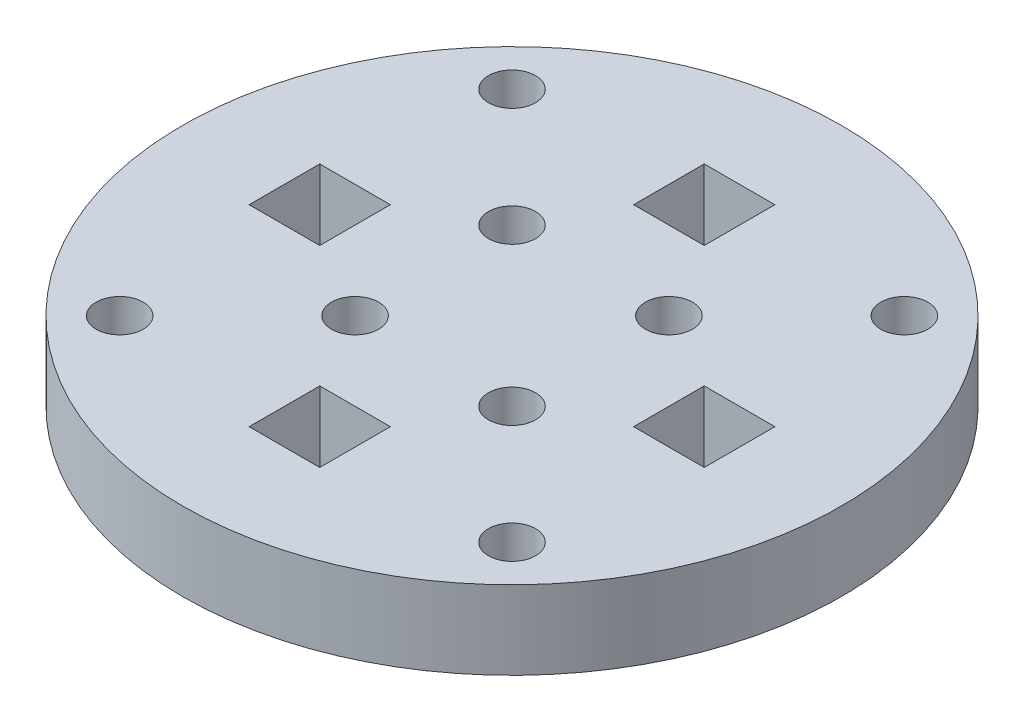
ISO-10303-21;
HEADER;
FILE_DESCRIPTION(('STEP AP214'),'2;1');
FILE_NAME('part.step','',(''),(''),'','','');
FILE_SCHEMA(('AUTOMOTIVE_DESIGN { 1 0 10303 214 1 1 1 1 }'));
ENDSEC;
DATA;
#1=APPLICATION_CONTEXT('core data for automotive mechanical design processes');
#2=APPLICATION_PROTOCOL_DEFINITION('international standard','automotive_design',2000,#1);
#3=PRODUCT_CONTEXT('',#1,'mechanical');
#4=PRODUCT('Part','Part','',(#3));
#5=PRODUCT_RELATED_PRODUCT_CATEGORY('part','',(#4));
#6=PRODUCT_DEFINITION_FORMATION('','',#4);
#7=PRODUCT_DEFINITION_CONTEXT('part definition',#1,'design');
#8=PRODUCT_DEFINITION('design','',#6,#7);
#9=PRODUCT_DEFINITION_SHAPE('','',#8);
#10=(LENGTH_UNIT() NAMED_UNIT(*) SI_UNIT(.MILLI.,.METRE.));
#11=(NAMED_UNIT(*) PLANE_ANGLE_UNIT() SI_UNIT($,.RADIAN.));
#12=(NAMED_UNIT(*) SI_UNIT($,.STERADIAN.) SOLID_ANGLE_UNIT());
#13=UNCERTAINTY_MEASURE_WITH_UNIT(LENGTH_MEASURE(1.E-05),#10,'distance_accuracy_value','');
#14=(GEOMETRIC_REPRESENTATION_CONTEXT(3) GLOBAL_UNCERTAINTY_ASSIGNED_CONTEXT((#13)) GLOBAL_UNIT_ASSIGNED_CONTEXT((#10,
#11,#12)) REPRESENTATION_CONTEXT('',''));
#15=CARTESIAN_POINT('',(0.,0.,0.));
#16=DIRECTION('',(0.,0.,1.));
#17=DIRECTION('',(1.,0.,0.));
#18=AXIS2_PLACEMENT_3D('',#15,#16,#17);
#19=CARTESIAN_POINT('',(0.,2.5,0.));
#20=DIRECTION('',(0.,1.,0.));
#21=DIRECTION('',(0.,0.,1.));
#22=AXIS2_PLACEMENT_3D('',#19,#20,#21);
#23=PLANE('',#22);
#24=DIRECTION('',(1.,0.,0.));
#25=VECTOR('',#24,1.);
#26=CARTESIAN_POINT('',(-14.5,2.5,2.24999999999985));
#27=LINE('',#26,#25);
#28=CARTESIAN_POINT('',(-14.5,2.5,2.24999999999985));
#29=VERTEX_POINT('',#28);
#30=CARTESIAN_POINT('',(-10.,2.5,2.2499999999999));
#31=VERTEX_POINT('',#30);
#32=EDGE_CURVE('E154',#29,#31,#27,.T.);
#33=ORIENTED_EDGE('',*,*,#32,.F.);
#34=DIRECTION('',(0.,0.,1.));
#35=VECTOR('',#34,1.);
#36=CARTESIAN_POINT('',(-14.5,2.5,2.24999999999985));
#37=LINE('',#36,#35);
#38=CARTESIAN_POINT('',(-14.5,2.5,-2.25000000000015));
#39=VERTEX_POINT('',#38);
#40=EDGE_CURVE('E146',#39,#29,#37,.T.);
#41=ORIENTED_EDGE('',*,*,#40,.F.);
#42=DIRECTION('',(-1.,0.,0.));
#43=VECTOR('',#42,1.);
#44=CARTESIAN_POINT('',(-14.5,2.5,-2.25000000000015));
#45=LINE('',#44,#43);
#46=CARTESIAN_POINT('',(-9.99999999999998,2.5,-2.2500000000001));
#47=VERTEX_POINT('',#46);
#48=EDGE_CURVE('E169',#47,#39,#45,.T.);
#49=ORIENTED_EDGE('',*,*,#48,.F.);
#50=DIRECTION('',(0.,0.,-1.));
#51=VECTOR('',#50,1.);
#52=CARTESIAN_POINT('',(-10.,2.5,2.2499999999999));
#53=LINE('',#52,#51);
#54=EDGE_CURVE('E167',#31,#47,#53,.T.);
#55=ORIENTED_EDGE('',*,*,#54,.F.);
#56=EDGE_LOOP('',(#33,#41,#49,#55));
#57=FACE_BOUND('',#56,.T.);
#58=DIRECTION('',(0.,0.,-1.));
#59=VECTOR('',#58,1.);
#60=CARTESIAN_POINT('',(2.2499999999999,2.5,14.5));
#61=LINE('',#60,#59);
#62=CARTESIAN_POINT('',(2.2499999999999,2.5,14.5));
#63=VERTEX_POINT('',#62);
#64=CARTESIAN_POINT('',(2.24999999999993,2.5,10.));
#65=VERTEX_POINT('',#64);
#66=EDGE_CURVE('E193',#63,#65,#61,.T.);
#67=ORIENTED_EDGE('',*,*,#66,.F.);
#68=DIRECTION('',(1.,0.,0.));
#69=VECTOR('',#68,1.);
#70=CARTESIAN_POINT('',(2.2499999999999,2.5,14.5));
#71=LINE('',#70,#69);
#72=CARTESIAN_POINT('',(-2.2500000000001,2.5,14.5));
#73=VERTEX_POINT('',#72);
#74=EDGE_CURVE('E191',#73,#63,#71,.T.);
#75=ORIENTED_EDGE('',*,*,#74,.F.);
#76=DIRECTION('',(0.,0.,1.));
#77=VECTOR('',#76,1.);
#78=CARTESIAN_POINT('',(-2.2500000000001,2.5,14.5));
#79=LINE('',#78,#77);
#80=CARTESIAN_POINT('',(-2.25000000000007,2.5,9.99999999999998));
#81=VERTEX_POINT('',#80);
#82=EDGE_CURVE('E199',#81,#73,#79,.T.);
#83=ORIENTED_EDGE('',*,*,#82,.F.);
#84=DIRECTION('',(-1.,0.,0.));
#85=VECTOR('',#84,1.);
#86=CARTESIAN_POINT('',(2.24999999999993,2.5,10.));
#87=LINE('',#86,#85);
#88=EDGE_CURVE('E196',#65,#81,#87,.T.);
#89=ORIENTED_EDGE('',*,*,#88,.F.);
#90=EDGE_LOOP('',(#67,#75,#83,#89));
#91=FACE_BOUND('',#90,.T.);
#92=CARTESIAN_POINT('',(5.00000000000003,2.5,-4.99999999999997));
#93=DIRECTION('',(0.,1.,0.));
#94=DIRECTION('',(0.,0.,1.));
#95=AXIS2_PLACEMENT_3D('',#92,#93,#94);
#96=CIRCLE('',#95,1.5);
#97=CARTESIAN_POINT('',(5.00000000000003,2.5,-3.49999999999996));
#98=VERTEX_POINT('',#97);
#99=EDGE_CURVE('E228',#98,#98,#96,.T.);
#100=ORIENTED_EDGE('',*,*,#99,.F.);
#101=EDGE_LOOP('',(#100));
#102=FACE_BOUND('',#101,.T.);
#103=CARTESIAN_POINT('',(12.5,2.5,-12.5000000000006));
#104=DIRECTION('',(0.,1.,0.));
#105=DIRECTION('',(0.,0.,1.));
#106=AXIS2_PLACEMENT_3D('',#103,#104,#105);
#107=CIRCLE('',#106,1.5);
#108=CARTESIAN_POINT('',(12.5,2.5,-11.0000000000006));
#109=VERTEX_POINT('',#108);
#110=EDGE_CURVE('E240',#109,#109,#107,.T.);
#111=ORIENTED_EDGE('',*,*,#110,.F.);
#112=EDGE_LOOP('',(#111));
#113=FACE_BOUND('',#112,.T.);
#114=CARTESIAN_POINT('',(-4.99999999999998,2.5,-5.00000000000002));
#115=DIRECTION('',(0.,1.,0.));
#116=DIRECTION('',(0.,0.,1.));
#117=AXIS2_PLACEMENT_3D('',#114,#115,#116);
#118=CIRCLE('',#117,1.5);
#119=CARTESIAN_POINT('',(-4.99999999999998,2.5,-3.50000000000002));
#120=VERTEX_POINT('',#119);
#121=EDGE_CURVE('E277',#120,#120,#118,.T.);
#122=ORIENTED_EDGE('',*,*,#121,.F.);
#123=EDGE_LOOP('',(#122));
#124=FACE_BOUND('',#123,.T.);
#125=DIRECTION('',(1.,0.,0.));
#126=VECTOR('',#125,1.);
#127=CARTESIAN_POINT('',(-2.25,2.5,-10.));
#128=LINE('',#127,#126);
#129=CARTESIAN_POINT('',(-2.25,2.5,-10.));
#130=VERTEX_POINT('',#129);
#131=CARTESIAN_POINT('',(2.25,2.5,-10.));
#132=VERTEX_POINT('',#131);
#133=EDGE_CURVE('E291',#130,#132,#128,.T.);
#134=ORIENTED_EDGE('',*,*,#133,.F.);
#135=DIRECTION('',(0.,0.,1.));
#136=VECTOR('',#135,1.);
#137=CARTESIAN_POINT('',(-2.25,2.5,-14.5));
#138=LINE('',#137,#136);
#139=CARTESIAN_POINT('',(-2.25,2.5,-14.5));
#140=VERTEX_POINT('',#139);
#141=EDGE_CURVE('E289',#140,#130,#138,.T.);
#142=ORIENTED_EDGE('',*,*,#141,.F.);
#143=DIRECTION('',(-1.,0.,0.));
#144=VECTOR('',#143,1.);
#145=CARTESIAN_POINT('',(-2.25,2.5,-14.5));
#146=LINE('',#145,#144);
#147=CARTESIAN_POINT('',(2.25,2.5,-14.5));
#148=VERTEX_POINT('',#147);
#149=EDGE_CURVE('E297',#148,#140,#146,.T.);
#150=ORIENTED_EDGE('',*,*,#149,.F.);
#151=DIRECTION('',(0.,0.,-1.));
#152=VECTOR('',#151,1.);
#153=CARTESIAN_POINT('',(2.25,2.5,-14.5));
#154=LINE('',#153,#152);
#155=EDGE_CURVE('E294',#132,#148,#154,.T.);
#156=ORIENTED_EDGE('',*,*,#155,.F.);
#157=EDGE_LOOP('',(#134,#142,#150,#156));
#158=FACE_BOUND('',#157,.T.);
#159=CARTESIAN_POINT('',(0.,2.5,0.));
#160=DIRECTION('',(0.,1.,0.));
#161=DIRECTION('',(0.,0.,1.));
#162=AXIS2_PLACEMENT_3D('',#159,#160,#161);
#163=CIRCLE('',#162,21.);
#164=CARTESIAN_POINT('',(0.,2.5,21.));
#165=VERTEX_POINT('',#164);
#166=EDGE_CURVE('E11',#165,#165,#163,.T.);
#167=ORIENTED_EDGE('',*,*,#166,.T.);
#168=EDGE_LOOP('',(#167));
#169=FACE_BOUND('',#168,.T.);
#170=CARTESIAN_POINT('',(-12.5,2.5,-12.5));
#171=DIRECTION('',(0.,1.,0.));
#172=DIRECTION('',(0.,0.,1.));
#173=AXIS2_PLACEMENT_3D('',#170,#171,#172);
#174=CIRCLE('',#173,1.5);
#175=CARTESIAN_POINT('',(-12.5,2.5,-11.));
#176=VERTEX_POINT('',#175);
#177=EDGE_CURVE('E283',#176,#176,#174,.T.);
#178=ORIENTED_EDGE('',*,*,#177,.F.);
#179=EDGE_LOOP('',(#178));
#180=FACE_BOUND('',#179,.T.);
#181=DIRECTION('',(-1.,0.,0.));
#182=VECTOR('',#181,1.);
#183=CARTESIAN_POINT('',(14.5000000000002,2.5,-2.24999999999997));
#184=LINE('',#183,#182);
#185=CARTESIAN_POINT('',(14.5000000000002,2.5,-2.24999999999997));
#186=VERTEX_POINT('',#185);
#187=CARTESIAN_POINT('',(10.,2.5,-2.24999999999997));
#188=VERTEX_POINT('',#187);
#189=EDGE_CURVE('E248',#186,#188,#184,.T.);
#190=ORIENTED_EDGE('',*,*,#189,.F.);
#191=DIRECTION('',(0.,0.,-1.));
#192=VECTOR('',#191,1.);
#193=CARTESIAN_POINT('',(14.5000000000002,2.5,-2.24999999999997));
#194=LINE('',#193,#192);
#195=CARTESIAN_POINT('',(14.5000000000002,2.5,2.25000000000003));
#196=VERTEX_POINT('',#195);
#197=EDGE_CURVE('E246',#196,#186,#194,.T.);
#198=ORIENTED_EDGE('',*,*,#197,.F.);
#199=DIRECTION('',(1.,0.,0.));
#200=VECTOR('',#199,1.);
#201=CARTESIAN_POINT('',(14.5000000000002,2.5,2.25000000000003));
#202=LINE('',#201,#200);
#203=CARTESIAN_POINT('',(9.99999999999999,2.5,2.25000000000003));
#204=VERTEX_POINT('',#203);
#205=EDGE_CURVE('E254',#204,#196,#202,.T.);
#206=ORIENTED_EDGE('',*,*,#205,.F.);
#207=DIRECTION('',(0.,0.,1.));
#208=VECTOR('',#207,1.);
#209=CARTESIAN_POINT('',(10.,2.5,-2.24999999999997));
#210=LINE('',#209,#208);
#211=EDGE_CURVE('E251',#188,#204,#210,.T.);
#212=ORIENTED_EDGE('',*,*,#211,.F.);
#213=EDGE_LOOP('',(#190,#198,#206,#212));
#214=FACE_BOUND('',#213,.T.);
#215=CARTESIAN_POINT('',(12.5000000000006,2.5,12.4999999999994));
#216=DIRECTION('',(0.,1.,0.));
#217=DIRECTION('',(0.,0.,1.));
#218=AXIS2_PLACEMENT_3D('',#215,#216,#217);
#219=CIRCLE('',#218,1.5);
#220=CARTESIAN_POINT('',(12.5000000000006,2.5,13.9999999999994));
#221=VERTEX_POINT('',#220);
#222=EDGE_CURVE('E234',#221,#221,#219,.T.);
#223=ORIENTED_EDGE('',*,*,#222,.F.);
#224=EDGE_LOOP('',(#223));
#225=FACE_BOUND('',#224,.T.);
#226=CARTESIAN_POINT('',(-12.4999999999994,2.5,12.5));
#227=DIRECTION('',(0.,1.,0.));
#228=DIRECTION('',(0.,0.,1.));
#229=AXIS2_PLACEMENT_3D('',#226,#227,#228);
#230=CIRCLE('',#229,1.5);
#231=CARTESIAN_POINT('',(-12.4999999999994,2.5,14.));
#232=VERTEX_POINT('',#231);
#233=EDGE_CURVE('E222',#232,#232,#230,.T.);
#234=ORIENTED_EDGE('',*,*,#233,.F.);
#235=EDGE_LOOP('',(#234));
#236=FACE_BOUND('',#235,.T.);
#237=CARTESIAN_POINT('',(4.99999999999995,2.5,5.00000000000005));
#238=DIRECTION('',(0.,1.,0.));
#239=DIRECTION('',(0.,0.,1.));
#240=AXIS2_PLACEMENT_3D('',#237,#238,#239);
#241=CIRCLE('',#240,1.5);
#242=CARTESIAN_POINT('',(4.99999999999995,2.5,6.50000000000005));
#243=VERTEX_POINT('',#242);
#244=EDGE_CURVE('E185',#243,#243,#241,.T.);
#245=ORIENTED_EDGE('',*,*,#244,.F.);
#246=EDGE_LOOP('',(#245));
#247=FACE_BOUND('',#246,.T.);
#248=CARTESIAN_POINT('',(-5.00000000000007,2.5,4.99999999999993));
#249=DIRECTION('',(0.,1.,0.));
#250=DIRECTION('',(0.,0.,1.));
#251=AXIS2_PLACEMENT_3D('',#248,#249,#250);
#252=CIRCLE('',#251,1.5);
#253=CARTESIAN_POINT('',(-5.00000000000007,2.5,6.49999999999993));
#254=VERTEX_POINT('',#253);
#255=EDGE_CURVE('E175',#254,#254,#252,.T.);
#256=ORIENTED_EDGE('',*,*,#255,.F.);
#257=EDGE_LOOP('',(#256));
#258=FACE_BOUND('',#257,.T.);
#259=ADVANCED_FACE('F33',(#57,#91,#102,#113,#124,#158,#169,#180,#214,#225,#236,#247,#258),#23,.T.);
#260=CARTESIAN_POINT('',(0.,-2.5,0.));
#261=DIRECTION('',(0.,1.,0.));
#262=DIRECTION('',(0.,0.,1.));
#263=AXIS2_PLACEMENT_3D('',#260,#261,#262);
#264=PLANE('',#263);
#265=DIRECTION('',(0.,0.,1.));
#266=VECTOR('',#265,1.);
#267=CARTESIAN_POINT('',(-14.5,-2.5,2.24999999999985));
#268=LINE('',#267,#266);
#269=CARTESIAN_POINT('',(-14.5,-2.5,-2.25000000000015));
#270=VERTEX_POINT('',#269);
#271=CARTESIAN_POINT('',(-14.5,-2.5,2.24999999999985));
#272=VERTEX_POINT('',#271);
#273=EDGE_CURVE('E56',#270,#272,#268,.T.);
#274=ORIENTED_EDGE('',*,*,#273,.T.);
#275=DIRECTION('',(1.,0.,0.));
#276=VECTOR('',#275,1.);
#277=CARTESIAN_POINT('',(-14.5,-2.5,2.24999999999985));
#278=LINE('',#277,#276);
#279=CARTESIAN_POINT('',(-10.,-2.5,2.2499999999999));
#280=VERTEX_POINT('',#279);
#281=EDGE_CURVE('E161',#272,#280,#278,.T.);
#282=ORIENTED_EDGE('',*,*,#281,.T.);
#283=DIRECTION('',(0.,0.,-1.));
#284=VECTOR('',#283,1.);
#285=CARTESIAN_POINT('',(-10.,-2.5,2.2499999999999));
#286=LINE('',#285,#284);
#287=CARTESIAN_POINT('',(-9.99999999999998,-2.5,-2.2500000000001));
#288=VERTEX_POINT('',#287);
#289=EDGE_CURVE('E177',#280,#288,#286,.T.);
#290=ORIENTED_EDGE('',*,*,#289,.T.);
#291=DIRECTION('',(-1.,0.,0.));
#292=VECTOR('',#291,1.);
#293=CARTESIAN_POINT('',(-14.5,-2.5,-2.25000000000015));
#294=LINE('',#293,#292);
#295=EDGE_CURVE('E155',#288,#270,#294,.T.);
#296=ORIENTED_EDGE('',*,*,#295,.T.);
#297=EDGE_LOOP('',(#274,#282,#290,#296));
#298=FACE_BOUND('',#297,.T.);
#299=DIRECTION('',(1.,0.,0.));
#300=VECTOR('',#299,1.);
#301=CARTESIAN_POINT('',(2.2499999999999,-2.5,14.5));
#302=LINE('',#301,#300);
#303=CARTESIAN_POINT('',(-2.2500000000001,-2.5,14.5));
#304=VERTEX_POINT('',#303);
#305=CARTESIAN_POINT('',(2.2499999999999,-2.5,14.5));
#306=VERTEX_POINT('',#305);
#307=EDGE_CURVE('E188',#304,#306,#302,.T.);
#308=ORIENTED_EDGE('',*,*,#307,.T.);
#309=DIRECTION('',(0.,0.,-1.));
#310=VECTOR('',#309,1.);
#311=CARTESIAN_POINT('',(2.2499999999999,-2.5,14.5));
#312=LINE('',#311,#310);
#313=CARTESIAN_POINT('',(2.24999999999993,-2.5,10.));
#314=VERTEX_POINT('',#313);
#315=EDGE_CURVE('E204',#306,#314,#312,.T.);
#316=ORIENTED_EDGE('',*,*,#315,.T.);
#317=DIRECTION('',(-1.,0.,0.));
#318=VECTOR('',#317,1.);
#319=CARTESIAN_POINT('',(2.24999999999993,-2.5,10.));
#320=LINE('',#319,#318);
#321=CARTESIAN_POINT('',(-2.25000000000007,-2.5,9.99999999999998));
#322=VERTEX_POINT('',#321);
#323=EDGE_CURVE('E207',#314,#322,#320,.T.);
#324=ORIENTED_EDGE('',*,*,#323,.T.);
#325=DIRECTION('',(0.,0.,1.));
#326=VECTOR('',#325,1.);
#327=CARTESIAN_POINT('',(-2.2500000000001,-2.5,14.5));
#328=LINE('',#327,#326);
#329=EDGE_CURVE('E194',#322,#304,#328,.T.);
#330=ORIENTED_EDGE('',*,*,#329,.T.);
#331=EDGE_LOOP('',(#308,#316,#324,#330));
#332=FACE_BOUND('',#331,.T.);
#333=CARTESIAN_POINT('',(5.00000000000003,-2.5,-4.99999999999997));
#334=DIRECTION('',(0.,1.,0.));
#335=DIRECTION('',(0.,0.,1.));
#336=AXIS2_PLACEMENT_3D('',#333,#334,#335);
#337=CIRCLE('',#336,1.5);
#338=CARTESIAN_POINT('',(5.00000000000003,-2.5,-3.49999999999996));
#339=VERTEX_POINT('',#338);
#340=EDGE_CURVE('E225',#339,#339,#337,.T.);
#341=ORIENTED_EDGE('',*,*,#340,.T.);
#342=EDGE_LOOP('',(#341));
#343=FACE_BOUND('',#342,.T.);
#344=CARTESIAN_POINT('',(12.5,-2.5,-12.5000000000006));
#345=DIRECTION('',(0.,1.,0.));
#346=DIRECTION('',(0.,0.,1.));
#347=AXIS2_PLACEMENT_3D('',#344,#345,#346);
#348=CIRCLE('',#347,1.5);
#349=CARTESIAN_POINT('',(12.5,-2.5,-11.0000000000006));
#350=VERTEX_POINT('',#349);
#351=EDGE_CURVE('E237',#350,#350,#348,.T.);
#352=ORIENTED_EDGE('',*,*,#351,.T.);
#353=EDGE_LOOP('',(#352));
#354=FACE_BOUND('',#353,.T.);
#355=CARTESIAN_POINT('',(-4.99999999999998,-2.5,-5.00000000000002));
#356=DIRECTION('',(0.,1.,0.));
#357=DIRECTION('',(0.,0.,1.));
#358=AXIS2_PLACEMENT_3D('',#355,#356,#357);
#359=CIRCLE('',#358,1.5);
#360=CARTESIAN_POINT('',(-4.99999999999998,-2.5,-3.50000000000002));
#361=VERTEX_POINT('',#360);
#362=EDGE_CURVE('E276',#361,#361,#359,.T.);
#363=ORIENTED_EDGE('',*,*,#362,.T.);
#364=EDGE_LOOP('',(#363));
#365=FACE_BOUND('',#364,.T.);
#366=DIRECTION('',(0.,0.,1.));
#367=VECTOR('',#366,1.);
#368=CARTESIAN_POINT('',(-2.25,-2.5,-14.5));
#369=LINE('',#368,#367);
#370=CARTESIAN_POINT('',(-2.25,-2.5,-14.5));
#371=VERTEX_POINT('',#370);
#372=CARTESIAN_POINT('',(-2.25,-2.5,-10.));
#373=VERTEX_POINT('',#372);
#374=EDGE_CURVE('E286',#371,#373,#369,.T.);
#375=ORIENTED_EDGE('',*,*,#374,.T.);
#376=DIRECTION('',(1.,0.,0.));
#377=VECTOR('',#376,1.);
#378=CARTESIAN_POINT('',(-2.25,-2.5,-10.));
#379=LINE('',#378,#377);
#380=CARTESIAN_POINT('',(2.25,-2.5,-10.));
#381=VERTEX_POINT('',#380);
#382=EDGE_CURVE('E302',#373,#381,#379,.T.);
#383=ORIENTED_EDGE('',*,*,#382,.T.);
#384=DIRECTION('',(0.,0.,-1.));
#385=VECTOR('',#384,1.);
#386=CARTESIAN_POINT('',(2.25,-2.5,-14.5));
#387=LINE('',#386,#385);
#388=CARTESIAN_POINT('',(2.25,-2.5,-14.5));
#389=VERTEX_POINT('',#388);
#390=EDGE_CURVE('E305',#381,#389,#387,.T.);
#391=ORIENTED_EDGE('',*,*,#390,.T.);
#392=DIRECTION('',(-1.,0.,0.));
#393=VECTOR('',#392,1.);
#394=CARTESIAN_POINT('',(-2.25,-2.5,-14.5));
#395=LINE('',#394,#393);
#396=EDGE_CURVE('E292',#389,#371,#395,.T.);
#397=ORIENTED_EDGE('',*,*,#396,.T.);
#398=EDGE_LOOP('',(#375,#383,#391,#397));
#399=FACE_BOUND('',#398,.T.);
#400=CARTESIAN_POINT('',(0.,-2.5,0.));
#401=DIRECTION('',(0.,1.,0.));
#402=DIRECTION('',(0.,0.,1.));
#403=AXIS2_PLACEMENT_3D('',#400,#401,#402);
#404=CIRCLE('',#403,21.);
#405=CARTESIAN_POINT('',(0.,-2.5,21.));
#406=VERTEX_POINT('',#405);
#407=EDGE_CURVE('E37',#406,#406,#404,.T.);
#408=ORIENTED_EDGE('',*,*,#407,.F.);
#409=EDGE_LOOP('',(#408));
#410=FACE_BOUND('',#409,.T.);
#411=CARTESIAN_POINT('',(-12.5,-2.5,-12.5));
#412=DIRECTION('',(0.,1.,0.));
#413=DIRECTION('',(0.,0.,1.));
#414=AXIS2_PLACEMENT_3D('',#411,#412,#413);
#415=CIRCLE('',#414,1.5);
#416=CARTESIAN_POINT('',(-12.5,-2.5,-11.));
#417=VERTEX_POINT('',#416);
#418=EDGE_CURVE('E280',#417,#417,#415,.T.);
#419=ORIENTED_EDGE('',*,*,#418,.T.);
#420=EDGE_LOOP('',(#419));
#421=FACE_BOUND('',#420,.T.);
#422=DIRECTION('',(0.,0.,-1.));
#423=VECTOR('',#422,1.);
#424=CARTESIAN_POINT('',(14.5000000000002,-2.5,-2.24999999999997));
#425=LINE('',#424,#423);
#426=CARTESIAN_POINT('',(14.5000000000002,-2.5,2.25000000000003));
#427=VERTEX_POINT('',#426);
#428=CARTESIAN_POINT('',(14.5000000000002,-2.5,-2.24999999999997));
#429=VERTEX_POINT('',#428);
#430=EDGE_CURVE('E243',#427,#429,#425,.T.);
#431=ORIENTED_EDGE('',*,*,#430,.T.);
#432=DIRECTION('',(-1.,0.,0.));
#433=VECTOR('',#432,1.);
#434=CARTESIAN_POINT('',(14.5000000000002,-2.5,-2.24999999999997));
#435=LINE('',#434,#433);
#436=CARTESIAN_POINT('',(10.,-2.5,-2.24999999999997));
#437=VERTEX_POINT('',#436);
#438=EDGE_CURVE('E259',#429,#437,#435,.T.);
#439=ORIENTED_EDGE('',*,*,#438,.T.);
#440=DIRECTION('',(0.,0.,1.));
#441=VECTOR('',#440,1.);
#442=CARTESIAN_POINT('',(10.,-2.5,-2.24999999999997));
#443=LINE('',#442,#441);
#444=CARTESIAN_POINT('',(9.99999999999999,-2.5,2.25000000000003));
#445=VERTEX_POINT('',#444);
#446=EDGE_CURVE('E262',#437,#445,#443,.T.);
#447=ORIENTED_EDGE('',*,*,#446,.T.);
#448=DIRECTION('',(1.,0.,0.));
#449=VECTOR('',#448,1.);
#450=CARTESIAN_POINT('',(14.5000000000002,-2.5,2.25000000000003));
#451=LINE('',#450,#449);
#452=EDGE_CURVE('E249',#445,#427,#451,.T.);
#453=ORIENTED_EDGE('',*,*,#452,.T.);
#454=EDGE_LOOP('',(#431,#439,#447,#453));
#455=FACE_BOUND('',#454,.T.);
#456=CARTESIAN_POINT('',(12.5000000000006,-2.5,12.4999999999994));
#457=DIRECTION('',(0.,1.,0.));
#458=DIRECTION('',(0.,0.,1.));
#459=AXIS2_PLACEMENT_3D('',#456,#457,#458);
#460=CIRCLE('',#459,1.5);
#461=CARTESIAN_POINT('',(12.5000000000006,-2.5,13.9999999999994));
#462=VERTEX_POINT('',#461);
#463=EDGE_CURVE('E231',#462,#462,#460,.T.);
#464=ORIENTED_EDGE('',*,*,#463,.T.);
#465=EDGE_LOOP('',(#464));
#466=FACE_BOUND('',#465,.T.);
#467=CARTESIAN_POINT('',(-12.4999999999994,-2.5,12.5));
#468=DIRECTION('',(0.,1.,0.));
#469=DIRECTION('',(0.,0.,1.));
#470=AXIS2_PLACEMENT_3D('',#467,#468,#469);
#471=CIRCLE('',#470,1.5);
#472=CARTESIAN_POINT('',(-12.4999999999994,-2.5,14.));
#473=VERTEX_POINT('',#472);
#474=EDGE_CURVE('E221',#473,#473,#471,.T.);
#475=ORIENTED_EDGE('',*,*,#474,.T.);
#476=EDGE_LOOP('',(#475));
#477=FACE_BOUND('',#476,.T.);
#478=CARTESIAN_POINT('',(4.99999999999995,-2.5,5.00000000000005));
#479=DIRECTION('',(0.,1.,0.));
#480=DIRECTION('',(0.,0.,1.));
#481=AXIS2_PLACEMENT_3D('',#478,#479,#480);
#482=CIRCLE('',#481,1.5);
#483=CARTESIAN_POINT('',(4.99999999999995,-2.5,6.50000000000005));
#484=VERTEX_POINT('',#483);
#485=EDGE_CURVE('E162',#484,#484,#482,.T.);
#486=ORIENTED_EDGE('',*,*,#485,.T.);
#487=EDGE_LOOP('',(#486));
#488=FACE_BOUND('',#487,.T.);
#489=CARTESIAN_POINT('',(-5.00000000000007,-2.5,4.99999999999993));
#490=DIRECTION('',(0.,1.,0.));
#491=DIRECTION('',(0.,0.,1.));
#492=AXIS2_PLACEMENT_3D('',#489,#490,#491);
#493=CIRCLE('',#492,1.5);
#494=CARTESIAN_POINT('',(-5.00000000000007,-2.5,6.49999999999993));
#495=VERTEX_POINT('',#494);
#496=EDGE_CURVE('E339',#495,#495,#493,.T.);
#497=ORIENTED_EDGE('',*,*,#496,.T.);
#498=EDGE_LOOP('',(#497));
#499=FACE_BOUND('',#498,.T.);
#500=ADVANCED_FACE('F324',(#298,#332,#343,#354,#365,#399,#410,#421,#455,#466,#477,#488,#499),
#264,.F.);
#501=CARTESIAN_POINT('',(0.,2.5,0.));
#502=DIRECTION('',(0.,-1.,0.));
#503=DIRECTION('',(0.,0.,-1.));
#504=AXIS2_PLACEMENT_3D('',#501,#502,#503);
#505=CYLINDRICAL_SURFACE('',#504,21.);
#506=ORIENTED_EDGE('',*,*,#166,.F.);
#507=EDGE_LOOP('',(#506));
#508=FACE_BOUND('',#507,.T.);
#509=ORIENTED_EDGE('',*,*,#407,.T.);
#510=EDGE_LOOP('',(#509));
#511=FACE_BOUND('',#510,.T.);
#512=ADVANCED_FACE('F35',(#508,#511),#505,.T.);
#513=CARTESIAN_POINT('',(-2.25,2.5,-14.5));
#514=DIRECTION('',(1.,0.,0.));
#515=DIRECTION('',(0.,0.,-1.));
#516=AXIS2_PLACEMENT_3D('',#513,#514,#515);
#517=PLANE('',#516);
#518=ORIENTED_EDGE('',*,*,#374,.F.);
#519=DIRECTION('',(0.,-1.,0.));
#520=VECTOR('',#519,1.);
#521=CARTESIAN_POINT('',(-2.25,2.5,-14.5));
#522=LINE('',#521,#520);
#523=EDGE_CURVE('E299',#140,#371,#522,.T.);
#524=ORIENTED_EDGE('',*,*,#523,.F.);
#525=ORIENTED_EDGE('',*,*,#141,.T.);
#526=DIRECTION('',(0.,-1.,0.));
#527=VECTOR('',#526,1.);
#528=CARTESIAN_POINT('',(-2.25,2.5,-10.));
#529=LINE('',#528,#527);
#530=EDGE_CURVE('E316',#130,#373,#529,.T.);
#531=ORIENTED_EDGE('',*,*,#530,.T.);
#532=EDGE_LOOP('',(#518,#524,#525,#531));
#533=FACE_BOUND('',#532,.T.);
#534=ADVANCED_FACE('F352',(#533),#517,.T.);
#535=CARTESIAN_POINT('',(-2.25,2.5,-10.));
#536=DIRECTION('',(0.,0.,-1.));
#537=DIRECTION('',(-1.,0.,0.));
#538=AXIS2_PLACEMENT_3D('',#535,#536,#537);
#539=PLANE('',#538);
#540=ORIENTED_EDGE('',*,*,#382,.F.);
#541=ORIENTED_EDGE('',*,*,#530,.F.);
#542=ORIENTED_EDGE('',*,*,#133,.T.);
#543=DIRECTION('',(0.,-1.,0.));
#544=VECTOR('',#543,1.);
#545=CARTESIAN_POINT('',(2.25,2.5,-10.));
#546=LINE('',#545,#544);
#547=EDGE_CURVE('E314',#132,#381,#546,.T.);
#548=ORIENTED_EDGE('',*,*,#547,.T.);
#549=EDGE_LOOP('',(#540,#541,#542,#548));
#550=FACE_BOUND('',#549,.T.);
#551=ADVANCED_FACE('F355',(#550),#539,.T.);
#552=CARTESIAN_POINT('',(2.25,2.5,-14.5));
#553=DIRECTION('',(-1.,0.,0.));
#554=DIRECTION('',(0.,0.,1.));
#555=AXIS2_PLACEMENT_3D('',#552,#553,#554);
#556=PLANE('',#555);
#557=ORIENTED_EDGE('',*,*,#390,.F.);
#558=ORIENTED_EDGE('',*,*,#547,.F.);
#559=ORIENTED_EDGE('',*,*,#155,.T.);
#560=DIRECTION('',(0.,-1.,0.));
#561=VECTOR('',#560,1.);
#562=CARTESIAN_POINT('',(2.25,2.5,-14.5));
#563=LINE('',#562,#561);
#564=EDGE_CURVE('E312',#148,#389,#563,.T.);
#565=ORIENTED_EDGE('',*,*,#564,.T.);
#566=EDGE_LOOP('',(#557,#558,#559,#565));
#567=FACE_BOUND('',#566,.T.);
#568=ADVANCED_FACE('F358',(#567),#556,.T.);
#569=CARTESIAN_POINT('',(-2.25,2.5,-14.5));
#570=DIRECTION('',(0.,0.,1.));
#571=DIRECTION('',(1.,0.,0.));
#572=AXIS2_PLACEMENT_3D('',#569,#570,#571);
#573=PLANE('',#572);
#574=ORIENTED_EDGE('',*,*,#396,.F.);
#575=ORIENTED_EDGE('',*,*,#564,.F.);
#576=ORIENTED_EDGE('',*,*,#149,.T.);
#577=ORIENTED_EDGE('',*,*,#523,.T.);
#578=EDGE_LOOP('',(#574,#575,#576,#577));
#579=FACE_BOUND('',#578,.T.);
#580=ADVANCED_FACE('F362',(#579),#573,.T.);
#581=CARTESIAN_POINT('',(-12.5,2.5,-12.5));
#582=DIRECTION('',(0.,-1.,0.));
#583=DIRECTION('',(0.,0.,-1.));
#584=AXIS2_PLACEMENT_3D('',#581,#582,#583);
#585=CYLINDRICAL_SURFACE('',#584,1.5);
#586=ORIENTED_EDGE('',*,*,#177,.T.);
#587=EDGE_LOOP('',(#586));
#588=FACE_BOUND('',#587,.T.);
#589=ORIENTED_EDGE('',*,*,#418,.F.);
#590=EDGE_LOOP('',(#589));
#591=FACE_BOUND('',#590,.T.);
#592=ADVANCED_FACE('F366',(#588,#591),#585,.F.);
#593=CARTESIAN_POINT('',(-4.99999999999998,2.5,-5.00000000000002));
#594=DIRECTION('',(0.,-1.,0.));
#595=DIRECTION('',(0.,0.,-1.));
#596=AXIS2_PLACEMENT_3D('',#593,#594,#595);
#597=CYLINDRICAL_SURFACE('',#596,1.5);
#598=ORIENTED_EDGE('',*,*,#121,.T.);
#599=EDGE_LOOP('',(#598));
#600=FACE_BOUND('',#599,.T.);
#601=ORIENTED_EDGE('',*,*,#362,.F.);
#602=EDGE_LOOP('',(#601));
#603=FACE_BOUND('',#602,.T.);
#604=ADVANCED_FACE('F370',(#600,#603),#597,.F.);
#605=CARTESIAN_POINT('',(14.5000000000002,2.5,-2.24999999999997));
#606=DIRECTION('',(-1.,0.,0.));
#607=DIRECTION('',(0.,0.,1.));
#608=AXIS2_PLACEMENT_3D('',#605,#606,#607);
#609=PLANE('',#608);
#610=ORIENTED_EDGE('',*,*,#430,.F.);
#611=DIRECTION('',(0.,-1.,0.));
#612=VECTOR('',#611,1.);
#613=CARTESIAN_POINT('',(14.5000000000002,2.5,2.25000000000003));
#614=LINE('',#613,#612);
#615=EDGE_CURVE('E256',#196,#427,#614,.T.);
#616=ORIENTED_EDGE('',*,*,#615,.F.);
#617=ORIENTED_EDGE('',*,*,#197,.T.);
#618=DIRECTION('',(0.,-1.,0.));
#619=VECTOR('',#618,1.);
#620=CARTESIAN_POINT('',(14.5000000000002,2.5,-2.24999999999997));
#621=LINE('',#620,#619);
#622=EDGE_CURVE('E273',#186,#429,#621,.T.);
#623=ORIENTED_EDGE('',*,*,#622,.T.);
#624=EDGE_LOOP('',(#610,#616,#617,#623));
#625=FACE_BOUND('',#624,.T.);
#626=ADVANCED_FACE('F374',(#625),#609,.T.);
#627=CARTESIAN_POINT('',(14.5000000000002,2.5,-2.24999999999997));
#628=DIRECTION('',(0.,0.,1.));
#629=DIRECTION('',(1.,0.,0.));
#630=AXIS2_PLACEMENT_3D('',#627,#628,#629);
#631=PLANE('',#630);
#632=ORIENTED_EDGE('',*,*,#438,.F.);
#633=ORIENTED_EDGE('',*,*,#622,.F.);
#634=ORIENTED_EDGE('',*,*,#189,.T.);
#635=DIRECTION('',(0.,-1.,0.));
#636=VECTOR('',#635,1.);
#637=CARTESIAN_POINT('',(10.,2.5,-2.24999999999997));
#638=LINE('',#637,#636);
#639=EDGE_CURVE('E271',#188,#437,#638,.T.);
#640=ORIENTED_EDGE('',*,*,#639,.T.);
#641=EDGE_LOOP('',(#632,#633,#634,#640));
#642=FACE_BOUND('',#641,.T.);
#643=ADVANCED_FACE('F378',(#642),#631,.T.);
#644=CARTESIAN_POINT('',(10.,2.5,-2.24999999999997));
#645=DIRECTION('',(1.,0.,0.));
#646=DIRECTION('',(0.,0.,-1.));
#647=AXIS2_PLACEMENT_3D('',#644,#645,#646);
#648=PLANE('',#647);
#649=ORIENTED_EDGE('',*,*,#446,.F.);
#650=ORIENTED_EDGE('',*,*,#639,.F.);
#651=ORIENTED_EDGE('',*,*,#211,.T.);
#652=DIRECTION('',(0.,-1.,0.));
#653=VECTOR('',#652,1.);
#654=CARTESIAN_POINT('',(9.99999999999999,2.5,2.25000000000003));
#655=LINE('',#654,#653);
#656=EDGE_CURVE('E269',#204,#445,#655,.T.);
#657=ORIENTED_EDGE('',*,*,#656,.T.);
#658=EDGE_LOOP('',(#649,#650,#651,#657));
#659=FACE_BOUND('',#658,.T.);
#660=ADVANCED_FACE('F382',(#659),#648,.T.);
#661=CARTESIAN_POINT('',(14.5000000000002,2.5,2.25000000000003));
#662=DIRECTION('',(0.,0.,-1.));
#663=DIRECTION('',(-1.,0.,0.));
#664=AXIS2_PLACEMENT_3D('',#661,#662,#663);
#665=PLANE('',#664);
#666=ORIENTED_EDGE('',*,*,#452,.F.);
#667=ORIENTED_EDGE('',*,*,#656,.F.);
#668=ORIENTED_EDGE('',*,*,#205,.T.);
#669=ORIENTED_EDGE('',*,*,#615,.T.);
#670=EDGE_LOOP('',(#666,#667,#668,#669));
#671=FACE_BOUND('',#670,.T.);
#672=ADVANCED_FACE('F386',(#671),#665,.T.);
#673=CARTESIAN_POINT('',(12.5,2.5,-12.5000000000006));
#674=DIRECTION('',(0.,-1.,0.));
#675=DIRECTION('',(0.,0.,-1.));
#676=AXIS2_PLACEMENT_3D('',#673,#674,#675);
#677=CYLINDRICAL_SURFACE('',#676,1.5);
#678=ORIENTED_EDGE('',*,*,#110,.T.);
#679=EDGE_LOOP('',(#678));
#680=FACE_BOUND('',#679,.T.);
#681=ORIENTED_EDGE('',*,*,#351,.F.);
#682=EDGE_LOOP('',(#681));
#683=FACE_BOUND('',#682,.T.);
#684=ADVANCED_FACE('F390',(#680,#683),#677,.F.);
#685=CARTESIAN_POINT('',(12.5000000000006,2.5,12.4999999999994));
#686=DIRECTION('',(0.,-1.,0.));
#687=DIRECTION('',(0.,0.,-1.));
#688=AXIS2_PLACEMENT_3D('',#685,#686,#687);
#689=CYLINDRICAL_SURFACE('',#688,1.5);
#690=ORIENTED_EDGE('',*,*,#222,.T.);
#691=EDGE_LOOP('',(#690));
#692=FACE_BOUND('',#691,.T.);
#693=ORIENTED_EDGE('',*,*,#463,.F.);
#694=EDGE_LOOP('',(#693));
#695=FACE_BOUND('',#694,.T.);
#696=ADVANCED_FACE('F394',(#692,#695),#689,.F.);
#697=CARTESIAN_POINT('',(5.00000000000003,2.5,-4.99999999999997));
#698=DIRECTION('',(0.,-1.,0.));
#699=DIRECTION('',(0.,0.,-1.));
#700=AXIS2_PLACEMENT_3D('',#697,#698,#699);
#701=CYLINDRICAL_SURFACE('',#700,1.5);
#702=ORIENTED_EDGE('',*,*,#99,.T.);
#703=EDGE_LOOP('',(#702));
#704=FACE_BOUND('',#703,.T.);
#705=ORIENTED_EDGE('',*,*,#340,.F.);
#706=EDGE_LOOP('',(#705));
#707=FACE_BOUND('',#706,.T.);
#708=ADVANCED_FACE('F398',(#704,#707),#701,.F.);
#709=CARTESIAN_POINT('',(-12.4999999999994,2.5,12.5));
#710=DIRECTION('',(0.,-1.,0.));
#711=DIRECTION('',(0.,0.,-1.));
#712=AXIS2_PLACEMENT_3D('',#709,#710,#711);
#713=CYLINDRICAL_SURFACE('',#712,1.5);
#714=ORIENTED_EDGE('',*,*,#233,.T.);
#715=EDGE_LOOP('',(#714));
#716=FACE_BOUND('',#715,.T.);
#717=ORIENTED_EDGE('',*,*,#474,.F.);
#718=EDGE_LOOP('',(#717));
#719=FACE_BOUND('',#718,.T.);
#720=ADVANCED_FACE('F402',(#716,#719),#713,.F.);
#721=CARTESIAN_POINT('',(2.2499999999999,2.5,14.5));
#722=DIRECTION('',(0.,0.,-1.));
#723=DIRECTION('',(-1.,0.,0.));
#724=AXIS2_PLACEMENT_3D('',#721,#722,#723);
#725=PLANE('',#724);
#726=ORIENTED_EDGE('',*,*,#307,.F.);
#727=DIRECTION('',(0.,-1.,0.));
#728=VECTOR('',#727,1.);
#729=CARTESIAN_POINT('',(-2.2500000000001,2.5,14.5));
#730=LINE('',#729,#728);
#731=EDGE_CURVE('E201',#73,#304,#730,.T.);
#732=ORIENTED_EDGE('',*,*,#731,.F.);
#733=ORIENTED_EDGE('',*,*,#74,.T.);
#734=DIRECTION('',(0.,-1.,0.));
#735=VECTOR('',#734,1.);
#736=CARTESIAN_POINT('',(2.2499999999999,2.5,14.5));
#737=LINE('',#736,#735);
#738=EDGE_CURVE('E218',#63,#306,#737,.T.);
#739=ORIENTED_EDGE('',*,*,#738,.T.);
#740=EDGE_LOOP('',(#726,#732,#733,#739));
#741=FACE_BOUND('',#740,.T.);
#742=ADVANCED_FACE('F406',(#741),#725,.T.);
#743=CARTESIAN_POINT('',(2.2499999999999,2.5,14.5));
#744=DIRECTION('',(-1.,0.,0.));
#745=DIRECTION('',(0.,0.,1.));
#746=AXIS2_PLACEMENT_3D('',#743,#744,#745);
#747=PLANE('',#746);
#748=ORIENTED_EDGE('',*,*,#315,.F.);
#749=ORIENTED_EDGE('',*,*,#738,.F.);
#750=ORIENTED_EDGE('',*,*,#66,.T.);
#751=DIRECTION('',(0.,-1.,0.));
#752=VECTOR('',#751,1.);
#753=CARTESIAN_POINT('',(2.24999999999993,2.5,10.));
#754=LINE('',#753,#752);
#755=EDGE_CURVE('E216',#65,#314,#754,.T.);
#756=ORIENTED_EDGE('',*,*,#755,.T.);
#757=EDGE_LOOP('',(#748,#749,#750,#756));
#758=FACE_BOUND('',#757,.T.);
#759=ADVANCED_FACE('F410',(#758),#747,.T.);
#760=CARTESIAN_POINT('',(2.24999999999993,2.5,10.));
#761=DIRECTION('',(0.,0.,1.));
#762=DIRECTION('',(1.,0.,0.));
#763=AXIS2_PLACEMENT_3D('',#760,#761,#762);
#764=PLANE('',#763);
#765=ORIENTED_EDGE('',*,*,#323,.F.);
#766=ORIENTED_EDGE('',*,*,#755,.F.);
#767=ORIENTED_EDGE('',*,*,#88,.T.);
#768=DIRECTION('',(0.,-1.,0.));
#769=VECTOR('',#768,1.);
#770=CARTESIAN_POINT('',(-2.25000000000007,2.5,9.99999999999998));
#771=LINE('',#770,#769);
#772=EDGE_CURVE('E214',#81,#322,#771,.T.);
#773=ORIENTED_EDGE('',*,*,#772,.T.);
#774=EDGE_LOOP('',(#765,#766,#767,#773));
#775=FACE_BOUND('',#774,.T.);
#776=ADVANCED_FACE('F414',(#775),#764,.T.);
#777=CARTESIAN_POINT('',(-2.2500000000001,2.5,14.5));
#778=DIRECTION('',(1.,0.,0.));
#779=DIRECTION('',(0.,0.,-1.));
#780=AXIS2_PLACEMENT_3D('',#777,#778,#779);
#781=PLANE('',#780);
#782=ORIENTED_EDGE('',*,*,#329,.F.);
#783=ORIENTED_EDGE('',*,*,#772,.F.);
#784=ORIENTED_EDGE('',*,*,#82,.T.);
#785=ORIENTED_EDGE('',*,*,#731,.T.);
#786=EDGE_LOOP('',(#782,#783,#784,#785));
#787=FACE_BOUND('',#786,.T.);
#788=ADVANCED_FACE('F418',(#787),#781,.T.);
#789=CARTESIAN_POINT('',(4.99999999999995,2.5,5.00000000000005));
#790=DIRECTION('',(0.,-1.,0.));
#791=DIRECTION('',(0.,0.,-1.));
#792=AXIS2_PLACEMENT_3D('',#789,#790,#791);
#793=CYLINDRICAL_SURFACE('',#792,1.5);
#794=ORIENTED_EDGE('',*,*,#244,.T.);
#795=EDGE_LOOP('',(#794));
#796=FACE_BOUND('',#795,.T.);
#797=ORIENTED_EDGE('',*,*,#485,.F.);
#798=EDGE_LOOP('',(#797));
#799=FACE_BOUND('',#798,.T.);
#800=ADVANCED_FACE('F422',(#796,#799),#793,.F.);
#801=CARTESIAN_POINT('',(-14.5,2.5,2.24999999999985));
#802=DIRECTION('',(1.,0.,0.));
#803=DIRECTION('',(0.,0.,-1.));
#804=AXIS2_PLACEMENT_3D('',#801,#802,#803);
#805=PLANE('',#804);
#806=ORIENTED_EDGE('',*,*,#273,.F.);
#807=DIRECTION('',(0.,-1.,0.));
#808=VECTOR('',#807,1.);
#809=CARTESIAN_POINT('',(-14.5,2.5,-2.25000000000015));
#810=LINE('',#809,#808);
#811=EDGE_CURVE('E150',#39,#270,#810,.T.);
#812=ORIENTED_EDGE('',*,*,#811,.F.);
#813=ORIENTED_EDGE('',*,*,#40,.T.);
#814=DIRECTION('',(0.,-1.,0.));
#815=VECTOR('',#814,1.);
#816=CARTESIAN_POINT('',(-14.5,2.5,2.24999999999985));
#817=LINE('',#816,#815);
#818=EDGE_CURVE('E149',#29,#272,#817,.T.);
#819=ORIENTED_EDGE('',*,*,#818,.T.);
#820=EDGE_LOOP('',(#806,#812,#813,#819));
#821=FACE_BOUND('',#820,.T.);
#822=ADVANCED_FACE('F148',(#821),#805,.T.);
#823=CARTESIAN_POINT('',(-14.5,2.5,2.24999999999985));
#824=DIRECTION('',(0.,0.,-1.));
#825=DIRECTION('',(-1.,0.,0.));
#826=AXIS2_PLACEMENT_3D('',#823,#824,#825);
#827=PLANE('',#826);
#828=ORIENTED_EDGE('',*,*,#281,.F.);
#829=ORIENTED_EDGE('',*,*,#818,.F.);
#830=ORIENTED_EDGE('',*,*,#32,.T.);
#831=DIRECTION('',(0.,-1.,0.));
#832=VECTOR('',#831,1.);
#833=CARTESIAN_POINT('',(-10.,2.5,2.2499999999999));
#834=LINE('',#833,#832);
#835=EDGE_CURVE('E163',#31,#280,#834,.T.);
#836=ORIENTED_EDGE('',*,*,#835,.T.);
#837=EDGE_LOOP('',(#828,#829,#830,#836));
#838=FACE_BOUND('',#837,.T.);
#839=ADVANCED_FACE('F158',(#838),#827,.T.);
#840=CARTESIAN_POINT('',(-10.,2.5,2.2499999999999));
#841=DIRECTION('',(-1.,0.,0.));
#842=DIRECTION('',(0.,0.,1.));
#843=AXIS2_PLACEMENT_3D('',#840,#841,#842);
#844=PLANE('',#843);
#845=ORIENTED_EDGE('',*,*,#289,.F.);
#846=ORIENTED_EDGE('',*,*,#835,.F.);
#847=ORIENTED_EDGE('',*,*,#54,.T.);
#848=DIRECTION('',(0.,-1.,0.));
#849=VECTOR('',#848,1.);
#850=CARTESIAN_POINT('',(-9.99999999999998,2.5,-2.2500000000001));
#851=LINE('',#850,#849);
#852=EDGE_CURVE('E48',#47,#288,#851,.T.);
#853=ORIENTED_EDGE('',*,*,#852,.T.);
#854=EDGE_LOOP('',(#845,#846,#847,#853));
#855=FACE_BOUND('',#854,.T.);
#856=ADVANCED_FACE('F431',(#855),#844,.T.);
#857=CARTESIAN_POINT('',(-14.5,2.5,-2.25000000000015));
#858=DIRECTION('',(0.,0.,1.));
#859=DIRECTION('',(1.,0.,0.));
#860=AXIS2_PLACEMENT_3D('',#857,#858,#859);
#861=PLANE('',#860);
#862=ORIENTED_EDGE('',*,*,#295,.F.);
#863=ORIENTED_EDGE('',*,*,#852,.F.);
#864=ORIENTED_EDGE('',*,*,#48,.T.);
#865=ORIENTED_EDGE('',*,*,#811,.T.);
#866=EDGE_LOOP('',(#862,#863,#864,#865));
#867=FACE_BOUND('',#866,.T.);
#868=ADVANCED_FACE('F434',(#867),#861,.T.);
#869=CARTESIAN_POINT('',(-5.00000000000007,2.5,4.99999999999993));
#870=DIRECTION('',(0.,-1.,0.));
#871=DIRECTION('',(0.,0.,-1.));
#872=AXIS2_PLACEMENT_3D('',#869,#870,#871);
#873=CYLINDRICAL_SURFACE('',#872,1.5);
#874=ORIENTED_EDGE('',*,*,#255,.T.);
#875=EDGE_LOOP('',(#874));
#876=FACE_BOUND('',#875,.T.);
#877=ORIENTED_EDGE('',*,*,#496,.F.);
#878=EDGE_LOOP('',(#877));
#879=FACE_BOUND('',#878,.T.);
#880=ADVANCED_FACE('F345',(#876,#879),#873,.F.);
#881=CLOSED_SHELL('',(#259,#500,#512,#534,#551,#568,#580,#592,#604,#626,#643,#660,#672,#684,
#696,#708,#720,#742,#759,#776,#788,#800,#822,#839,#856,#868,#880));
#882=MANIFOLD_SOLID_BREP('B2',#881);
#883=ADVANCED_BREP_SHAPE_REPRESENTATION('',(#18,#882),#14);
#884=SHAPE_DEFINITION_REPRESENTATION(#9,#883);
ENDSEC;
END-ISO-10303-21;
